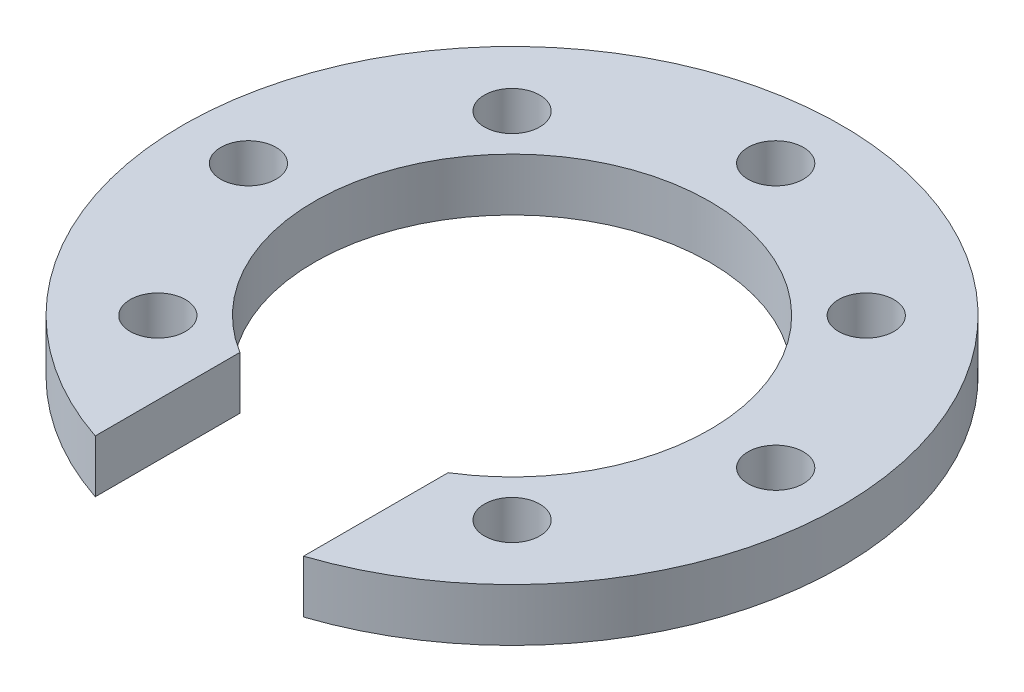
ISO-10303-21;
HEADER;
FILE_DESCRIPTION(('STEP AP214'),'2;1');
FILE_NAME('part.step','',(''),(''),'','','');
FILE_SCHEMA(('AUTOMOTIVE_DESIGN { 1 0 10303 214 1 1 1 1 }'));
ENDSEC;
DATA;
#1=APPLICATION_CONTEXT('core data for automotive mechanical design processes');
#2=APPLICATION_PROTOCOL_DEFINITION('international standard','automotive_design',2000,#1);
#3=PRODUCT_CONTEXT('',#1,'mechanical');
#4=PRODUCT('Part','Part','',(#3));
#5=PRODUCT_RELATED_PRODUCT_CATEGORY('part','',(#4));
#6=PRODUCT_DEFINITION_FORMATION('','',#4);
#7=PRODUCT_DEFINITION_CONTEXT('part definition',#1,'design');
#8=PRODUCT_DEFINITION('design','',#6,#7);
#9=PRODUCT_DEFINITION_SHAPE('','',#8);
#10=(LENGTH_UNIT() NAMED_UNIT(*) SI_UNIT(.MILLI.,.METRE.));
#11=(NAMED_UNIT(*) PLANE_ANGLE_UNIT() SI_UNIT($,.RADIAN.));
#12=(NAMED_UNIT(*) SI_UNIT($,.STERADIAN.) SOLID_ANGLE_UNIT());
#13=UNCERTAINTY_MEASURE_WITH_UNIT(LENGTH_MEASURE(1.E-05),#10,'distance_accuracy_value','');
#14=(GEOMETRIC_REPRESENTATION_CONTEXT(3) GLOBAL_UNCERTAINTY_ASSIGNED_CONTEXT((#13)) GLOBAL_UNIT_ASSIGNED_CONTEXT((#10,
#11,#12)) REPRESENTATION_CONTEXT('',''));
#15=CARTESIAN_POINT('',(0.,0.,0.));
#16=DIRECTION('',(0.,0.,1.));
#17=DIRECTION('',(1.,0.,0.));
#18=AXIS2_PLACEMENT_3D('',#15,#16,#17);
#19=CARTESIAN_POINT('',(0.,2.,0.));
#20=DIRECTION('',(0.,1.,0.));
#21=DIRECTION('',(0.,0.,1.));
#22=AXIS2_PLACEMENT_3D('',#19,#20,#21);
#23=PLANE('',#22);
#24=CARTESIAN_POINT('',(-6.71751442,2.,6.71751442));
#25=DIRECTION('',(0.,1.,0.));
#26=DIRECTION('',(0.,0.,1.));
#27=AXIS2_PLACEMENT_3D('',#24,#25,#26);
#28=CIRCLE('',#27,1.05);
#29=CARTESIAN_POINT('',(-6.71751442,2.,7.76751442));
#30=VERTEX_POINT('',#29);
#31=EDGE_CURVE('E137',#30,#30,#28,.T.);
#32=ORIENTED_EDGE('',*,*,#31,.F.);
#33=EDGE_LOOP('',(#32));
#34=FACE_BOUND('',#33,.T.);
#35=CARTESIAN_POINT('',(6.71751442,2.,6.71751442));
#36=DIRECTION('',(0.,1.,0.));
#37=DIRECTION('',(0.,0.,1.));
#38=AXIS2_PLACEMENT_3D('',#35,#36,#37);
#39=CIRCLE('',#38,1.05);
#40=CARTESIAN_POINT('',(6.71751442,2.,7.76751442));
#41=VERTEX_POINT('',#40);
#42=EDGE_CURVE('E148',#41,#41,#39,.T.);
#43=ORIENTED_EDGE('',*,*,#42,.F.);
#44=EDGE_LOOP('',(#43));
#45=FACE_BOUND('',#44,.T.);
#46=CARTESIAN_POINT('',(6.71751442,2.,-6.71751442));
#47=DIRECTION('',(0.,1.,0.));
#48=DIRECTION('',(0.,0.,1.));
#49=AXIS2_PLACEMENT_3D('',#46,#47,#48);
#50=CIRCLE('',#49,1.05);
#51=CARTESIAN_POINT('',(6.71751442,2.,-5.66751442));
#52=VERTEX_POINT('',#51);
#53=EDGE_CURVE('E142',#52,#52,#50,.T.);
#54=ORIENTED_EDGE('',*,*,#53,.F.);
#55=EDGE_LOOP('',(#54));
#56=FACE_BOUND('',#55,.T.);
#57=CARTESIAN_POINT('',(-6.71751442,2.,-6.71751442));
#58=DIRECTION('',(0.,1.,0.));
#59=DIRECTION('',(0.,0.,1.));
#60=AXIS2_PLACEMENT_3D('',#57,#58,#59);
#61=CIRCLE('',#60,1.05);
#62=CARTESIAN_POINT('',(-6.71751442,2.,-5.66751442));
#63=VERTEX_POINT('',#62);
#64=EDGE_CURVE('E141',#63,#63,#61,.T.);
#65=ORIENTED_EDGE('',*,*,#64,.F.);
#66=EDGE_LOOP('',(#65));
#67=FACE_BOUND('',#66,.T.);
#68=CARTESIAN_POINT('',(0.,2.,-10.));
#69=DIRECTION('',(0.,1.,0.));
#70=DIRECTION('',(1.,0.,0.));
#71=AXIS2_PLACEMENT_3D('',#68,#69,#70);
#72=CIRCLE('',#71,1.05);
#73=CARTESIAN_POINT('',(1.04999999999997,2.,-10.));
#74=VERTEX_POINT('',#73);
#75=EDGE_CURVE('E114',#74,#74,#72,.T.);
#76=ORIENTED_EDGE('',*,*,#75,.F.);
#77=EDGE_LOOP('',(#76));
#78=FACE_BOUND('',#77,.T.);
#79=CARTESIAN_POINT('',(-10.,2.,0.));
#80=DIRECTION('',(0.,1.,0.));
#81=DIRECTION('',(0.,0.,-1.));
#82=AXIS2_PLACEMENT_3D('',#79,#80,#81);
#83=CIRCLE('',#82,1.05);
#84=CARTESIAN_POINT('',(-10.,2.,-1.05));
#85=VERTEX_POINT('',#84);
#86=EDGE_CURVE('E123',#85,#85,#83,.T.);
#87=ORIENTED_EDGE('',*,*,#86,.F.);
#88=EDGE_LOOP('',(#87));
#89=FACE_BOUND('',#88,.T.);
#90=CARTESIAN_POINT('',(10.,2.,0.));
#91=DIRECTION('',(0.,1.,0.));
#92=DIRECTION('',(0.,0.,1.));
#93=AXIS2_PLACEMENT_3D('',#90,#91,#92);
#94=CIRCLE('',#93,1.05);
#95=CARTESIAN_POINT('',(10.,2.,1.05));
#96=VERTEX_POINT('',#95);
#97=EDGE_CURVE('E109',#96,#96,#94,.T.);
#98=ORIENTED_EDGE('',*,*,#97,.F.);
#99=EDGE_LOOP('',(#98));
#100=FACE_BOUND('',#99,.T.);
#101=CARTESIAN_POINT('',(0.,2.,0.));
#102=DIRECTION('',(0.,1.,0.));
#103=DIRECTION('',(0.,0.,1.));
#104=AXIS2_PLACEMENT_3D('',#101,#102,#103);
#105=CIRCLE('',#104,12.5);
#106=CARTESIAN_POINT('',(3.95,2.,11.8594898709852));
#107=VERTEX_POINT('',#106);
#108=CARTESIAN_POINT('',(-3.95,2.,11.8594898709852));
#109=VERTEX_POINT('',#108);
#110=EDGE_CURVE('E94',#107,#109,#105,.T.);
#111=ORIENTED_EDGE('',*,*,#110,.T.);
#112=DIRECTION('',(0.,0.,-1.));
#113=VECTOR('',#112,1.);
#114=CARTESIAN_POINT('',(-3.95,2.,0.));
#115=LINE('',#114,#113);
#116=CARTESIAN_POINT('',(-3.95,2.,6.37553919288401));
#117=VERTEX_POINT('',#116);
#118=EDGE_CURVE('E88',#109,#117,#115,.T.);
#119=ORIENTED_EDGE('',*,*,#118,.T.);
#120=CARTESIAN_POINT('',(0.,2.,0.));
#121=DIRECTION('',(0.,1.,0.));
#122=DIRECTION('',(0.,0.,1.));
#123=AXIS2_PLACEMENT_3D('',#120,#121,#122);
#124=CIRCLE('',#123,7.50000000000001);
#125=CARTESIAN_POINT('',(3.95,2.,6.37553919288401));
#126=VERTEX_POINT('',#125);
#127=EDGE_CURVE('E96',#126,#117,#124,.T.);
#128=ORIENTED_EDGE('',*,*,#127,.F.);
#129=DIRECTION('',(0.,0.,-1.));
#130=VECTOR('',#129,1.);
#131=CARTESIAN_POINT('',(3.95,2.,0.));
#132=LINE('',#131,#130);
#133=EDGE_CURVE('E63',#107,#126,#132,.T.);
#134=ORIENTED_EDGE('',*,*,#133,.F.);
#135=EDGE_LOOP('',(#111,#119,#128,#134));
#136=FACE_BOUND('',#135,.T.);
#137=ADVANCED_FACE('F41',(#34,#45,#56,#67,#78,#89,#100,#136),#23,.T.);
#138=CARTESIAN_POINT('',(0.,0.,0.));
#139=DIRECTION('',(0.,1.,0.));
#140=DIRECTION('',(0.,0.,1.));
#141=AXIS2_PLACEMENT_3D('',#138,#139,#140);
#142=PLANE('',#141);
#143=CARTESIAN_POINT('',(10.,0.,0.));
#144=DIRECTION('',(0.,1.,0.));
#145=DIRECTION('',(0.,0.,1.));
#146=AXIS2_PLACEMENT_3D('',#143,#144,#145);
#147=CIRCLE('',#146,1.05);
#148=CARTESIAN_POINT('',(10.,0.,1.05));
#149=VERTEX_POINT('',#148);
#150=EDGE_CURVE('E106',#149,#149,#147,.T.);
#151=ORIENTED_EDGE('',*,*,#150,.T.);
#152=EDGE_LOOP('',(#151));
#153=FACE_BOUND('',#152,.T.);
#154=CARTESIAN_POINT('',(-10.,0.,0.));
#155=DIRECTION('',(0.,1.,0.));
#156=DIRECTION('',(0.,0.,1.));
#157=AXIS2_PLACEMENT_3D('',#154,#155,#156);
#158=CIRCLE('',#157,1.05);
#159=CARTESIAN_POINT('',(-10.,0.,1.05));
#160=VERTEX_POINT('',#159);
#161=EDGE_CURVE('E110',#160,#160,#158,.T.);
#162=ORIENTED_EDGE('',*,*,#161,.T.);
#163=EDGE_LOOP('',(#162));
#164=FACE_BOUND('',#163,.T.);
#165=CARTESIAN_POINT('',(0.,0.,-10.));
#166=DIRECTION('',(0.,1.,0.));
#167=DIRECTION('',(0.,0.,1.));
#168=AXIS2_PLACEMENT_3D('',#165,#166,#167);
#169=CIRCLE('',#168,1.05);
#170=CARTESIAN_POINT('',(0.,0.,-8.95));
#171=VERTEX_POINT('',#170);
#172=EDGE_CURVE('E113',#171,#171,#169,.T.);
#173=ORIENTED_EDGE('',*,*,#172,.T.);
#174=EDGE_LOOP('',(#173));
#175=FACE_BOUND('',#174,.T.);
#176=CARTESIAN_POINT('',(-6.71751442,0.,-6.71751442));
#177=DIRECTION('',(0.,1.,0.));
#178=DIRECTION('',(0.,0.,1.));
#179=AXIS2_PLACEMENT_3D('',#176,#177,#178);
#180=CIRCLE('',#179,1.05);
#181=CARTESIAN_POINT('',(-6.71751442,0.,-5.66751442));
#182=VERTEX_POINT('',#181);
#183=EDGE_CURVE('E156',#182,#182,#180,.T.);
#184=ORIENTED_EDGE('',*,*,#183,.T.);
#185=EDGE_LOOP('',(#184));
#186=FACE_BOUND('',#185,.T.);
#187=CARTESIAN_POINT('',(6.71751442,0.,-6.71751442));
#188=DIRECTION('',(0.,1.,0.));
#189=DIRECTION('',(0.,0.,1.));
#190=AXIS2_PLACEMENT_3D('',#187,#188,#189);
#191=CIRCLE('',#190,1.05);
#192=CARTESIAN_POINT('',(6.71751442,0.,-5.66751442));
#193=VERTEX_POINT('',#192);
#194=EDGE_CURVE('E138',#193,#193,#191,.T.);
#195=ORIENTED_EDGE('',*,*,#194,.T.);
#196=EDGE_LOOP('',(#195));
#197=FACE_BOUND('',#196,.T.);
#198=CARTESIAN_POINT('',(6.71751442,0.,6.71751442));
#199=DIRECTION('',(0.,1.,0.));
#200=DIRECTION('',(0.,0.,1.));
#201=AXIS2_PLACEMENT_3D('',#198,#199,#200);
#202=CIRCLE('',#201,1.05);
#203=CARTESIAN_POINT('',(6.71751442,0.,7.76751442));
#204=VERTEX_POINT('',#203);
#205=EDGE_CURVE('E145',#204,#204,#202,.T.);
#206=ORIENTED_EDGE('',*,*,#205,.T.);
#207=EDGE_LOOP('',(#206));
#208=FACE_BOUND('',#207,.T.);
#209=CARTESIAN_POINT('',(-6.71751442,0.,6.71751442));
#210=DIRECTION('',(0.,1.,0.));
#211=DIRECTION('',(0.,0.,1.));
#212=AXIS2_PLACEMENT_3D('',#209,#210,#211);
#213=CIRCLE('',#212,1.05);
#214=CARTESIAN_POINT('',(-6.71751442,0.,7.76751442));
#215=VERTEX_POINT('',#214);
#216=EDGE_CURVE('E151',#215,#215,#213,.T.);
#217=ORIENTED_EDGE('',*,*,#216,.T.);
#218=EDGE_LOOP('',(#217));
#219=FACE_BOUND('',#218,.T.);
#220=DIRECTION('',(0.,0.,-1.));
#221=VECTOR('',#220,1.);
#222=CARTESIAN_POINT('',(-3.95,0.,0.));
#223=LINE('',#222,#221);
#224=CARTESIAN_POINT('',(-3.95,0.,11.8594898709852));
#225=VERTEX_POINT('',#224);
#226=CARTESIAN_POINT('',(-3.95,0.,6.37553919288401));
#227=VERTEX_POINT('',#226);
#228=EDGE_CURVE('E56',#225,#227,#223,.T.);
#229=ORIENTED_EDGE('',*,*,#228,.F.);
#230=CARTESIAN_POINT('',(0.,0.,0.));
#231=DIRECTION('',(0.,1.,0.));
#232=DIRECTION('',(0.,0.,1.));
#233=AXIS2_PLACEMENT_3D('',#230,#231,#232);
#234=CIRCLE('',#233,12.5);
#235=CARTESIAN_POINT('',(3.95,0.,11.8594898709852));
#236=VERTEX_POINT('',#235);
#237=EDGE_CURVE('E99',#236,#225,#234,.T.);
#238=ORIENTED_EDGE('',*,*,#237,.F.);
#239=DIRECTION('',(0.,0.,-1.));
#240=VECTOR('',#239,1.);
#241=CARTESIAN_POINT('',(3.95,0.,0.));
#242=LINE('',#241,#240);
#243=CARTESIAN_POINT('',(3.95,0.,6.37553919288401));
#244=VERTEX_POINT('',#243);
#245=EDGE_CURVE('E82',#236,#244,#242,.T.);
#246=ORIENTED_EDGE('',*,*,#245,.T.);
#247=CARTESIAN_POINT('',(0.,0.,0.));
#248=DIRECTION('',(0.,1.,0.));
#249=DIRECTION('',(0.,0.,1.));
#250=AXIS2_PLACEMENT_3D('',#247,#248,#249);
#251=CIRCLE('',#250,7.50000000000001);
#252=EDGE_CURVE('E103',#244,#227,#251,.T.);
#253=ORIENTED_EDGE('',*,*,#252,.T.);
#254=EDGE_LOOP('',(#229,#238,#246,#253));
#255=FACE_BOUND('',#254,.T.);
#256=ADVANCED_FACE('F129',(#153,#164,#175,#186,#197,#208,#219,#255),#142,.F.);
#257=CARTESIAN_POINT('',(0.,2.,0.));
#258=DIRECTION('',(0.,-1.,0.));
#259=DIRECTION('',(0.,0.,-1.));
#260=AXIS2_PLACEMENT_3D('',#257,#258,#259);
#261=CYLINDRICAL_SURFACE('',#260,12.5);
#262=DIRECTION('',(0.,1.,0.));
#263=VECTOR('',#262,1.);
#264=CARTESIAN_POINT('',(-3.95,-8.,11.8594898709852));
#265=LINE('',#264,#263);
#266=EDGE_CURVE('E87',#225,#109,#265,.T.);
#267=ORIENTED_EDGE('',*,*,#266,.T.);
#268=ORIENTED_EDGE('',*,*,#110,.F.);
#269=DIRECTION('',(0.,1.,0.));
#270=VECTOR('',#269,1.);
#271=CARTESIAN_POINT('',(3.95,-8.,11.8594898709852));
#272=LINE('',#271,#270);
#273=EDGE_CURVE('E79',#236,#107,#272,.T.);
#274=ORIENTED_EDGE('',*,*,#273,.F.);
#275=ORIENTED_EDGE('',*,*,#237,.T.);
#276=EDGE_LOOP('',(#267,#268,#274,#275));
#277=FACE_BOUND('',#276,.T.);
#278=ADVANCED_FACE('F43',(#277),#261,.T.);
#279=CARTESIAN_POINT('',(0.,2.,0.));
#280=DIRECTION('',(0.,-1.,0.));
#281=DIRECTION('',(0.,0.,-1.));
#282=AXIS2_PLACEMENT_3D('',#279,#280,#281);
#283=CYLINDRICAL_SURFACE('',#282,7.50000000000001);
#284=ORIENTED_EDGE('',*,*,#127,.T.);
#285=DIRECTION('',(0.,-1.,0.));
#286=VECTOR('',#285,1.);
#287=CARTESIAN_POINT('',(-3.95,2.,6.37553919288401));
#288=LINE('',#287,#286);
#289=EDGE_CURVE('E11',#117,#227,#288,.T.);
#290=ORIENTED_EDGE('',*,*,#289,.T.);
#291=ORIENTED_EDGE('',*,*,#252,.F.);
#292=DIRECTION('',(0.,-1.,0.));
#293=VECTOR('',#292,1.);
#294=CARTESIAN_POINT('',(3.95,2.,6.37553919288401));
#295=LINE('',#294,#293);
#296=EDGE_CURVE('E49',#126,#244,#295,.T.);
#297=ORIENTED_EDGE('',*,*,#296,.F.);
#298=EDGE_LOOP('',(#284,#290,#291,#297));
#299=FACE_BOUND('',#298,.T.);
#300=ADVANCED_FACE('F130',(#299),#283,.F.);
#301=CARTESIAN_POINT('',(10.,-3.,0.));
#302=DIRECTION('',(0.,1.,0.));
#303=DIRECTION('',(0.,0.,1.));
#304=AXIS2_PLACEMENT_3D('',#301,#302,#303);
#305=CYLINDRICAL_SURFACE('',#304,1.05);
#306=ORIENTED_EDGE('',*,*,#97,.T.);
#307=EDGE_LOOP('',(#306));
#308=FACE_BOUND('',#307,.T.);
#309=ORIENTED_EDGE('',*,*,#150,.F.);
#310=EDGE_LOOP('',(#309));
#311=FACE_BOUND('',#310,.T.);
#312=ADVANCED_FACE('F182',(#308,#311),#305,.F.);
#313=CARTESIAN_POINT('',(-10.,-3.,0.));
#314=DIRECTION('',(0.,1.,0.));
#315=DIRECTION('',(0.,0.,1.));
#316=AXIS2_PLACEMENT_3D('',#313,#314,#315);
#317=CYLINDRICAL_SURFACE('',#316,1.05);
#318=ORIENTED_EDGE('',*,*,#86,.T.);
#319=EDGE_LOOP('',(#318));
#320=FACE_BOUND('',#319,.T.);
#321=ORIENTED_EDGE('',*,*,#161,.F.);
#322=EDGE_LOOP('',(#321));
#323=FACE_BOUND('',#322,.T.);
#324=ADVANCED_FACE('F166',(#320,#323),#317,.F.);
#325=CARTESIAN_POINT('',(0.,-3.,-10.));
#326=DIRECTION('',(0.,1.,0.));
#327=DIRECTION('',(0.,0.,1.));
#328=AXIS2_PLACEMENT_3D('',#325,#326,#327);
#329=CYLINDRICAL_SURFACE('',#328,1.05);
#330=ORIENTED_EDGE('',*,*,#75,.T.);
#331=EDGE_LOOP('',(#330));
#332=FACE_BOUND('',#331,.T.);
#333=ORIENTED_EDGE('',*,*,#172,.F.);
#334=EDGE_LOOP('',(#333));
#335=FACE_BOUND('',#334,.T.);
#336=ADVANCED_FACE('F187',(#332,#335),#329,.F.);
#337=CARTESIAN_POINT('',(-6.71751442,0.,-6.71751442));
#338=DIRECTION('',(0.,1.,0.));
#339=DIRECTION('',(0.,0.,1.));
#340=AXIS2_PLACEMENT_3D('',#337,#338,#339);
#341=CYLINDRICAL_SURFACE('',#340,1.05);
#342=ORIENTED_EDGE('',*,*,#183,.F.);
#343=EDGE_LOOP('',(#342));
#344=FACE_BOUND('',#343,.T.);
#345=ORIENTED_EDGE('',*,*,#64,.T.);
#346=EDGE_LOOP('',(#345));
#347=FACE_BOUND('',#346,.T.);
#348=ADVANCED_FACE('F190',(#344,#347),#341,.F.);
#349=CARTESIAN_POINT('',(6.71751442,0.,-6.71751442));
#350=DIRECTION('',(0.,1.,0.));
#351=DIRECTION('',(0.,0.,1.));
#352=AXIS2_PLACEMENT_3D('',#349,#350,#351);
#353=CYLINDRICAL_SURFACE('',#352,1.05);
#354=ORIENTED_EDGE('',*,*,#194,.F.);
#355=EDGE_LOOP('',(#354));
#356=FACE_BOUND('',#355,.T.);
#357=ORIENTED_EDGE('',*,*,#53,.T.);
#358=EDGE_LOOP('',(#357));
#359=FACE_BOUND('',#358,.T.);
#360=ADVANCED_FACE('F193',(#356,#359),#353,.F.);
#361=CARTESIAN_POINT('',(6.71751442,0.,6.71751442));
#362=DIRECTION('',(0.,1.,0.));
#363=DIRECTION('',(0.,0.,1.));
#364=AXIS2_PLACEMENT_3D('',#361,#362,#363);
#365=CYLINDRICAL_SURFACE('',#364,1.05);
#366=ORIENTED_EDGE('',*,*,#205,.F.);
#367=EDGE_LOOP('',(#366));
#368=FACE_BOUND('',#367,.T.);
#369=ORIENTED_EDGE('',*,*,#42,.T.);
#370=EDGE_LOOP('',(#369));
#371=FACE_BOUND('',#370,.T.);
#372=ADVANCED_FACE('F198',(#368,#371),#365,.F.);
#373=CARTESIAN_POINT('',(-6.71751442,0.,6.71751442));
#374=DIRECTION('',(0.,1.,0.));
#375=DIRECTION('',(0.,0.,1.));
#376=AXIS2_PLACEMENT_3D('',#373,#374,#375);
#377=CYLINDRICAL_SURFACE('',#376,1.05);
#378=ORIENTED_EDGE('',*,*,#216,.F.);
#379=EDGE_LOOP('',(#378));
#380=FACE_BOUND('',#379,.T.);
#381=ORIENTED_EDGE('',*,*,#31,.T.);
#382=EDGE_LOOP('',(#381));
#383=FACE_BOUND('',#382,.T.);
#384=ADVANCED_FACE('F195',(#380,#383),#377,.F.);
#385=CARTESIAN_POINT('',(3.95,-8.,0.));
#386=DIRECTION('',(1.,0.,0.));
#387=DIRECTION('',(0.,0.,-1.));
#388=AXIS2_PLACEMENT_3D('',#385,#386,#387);
#389=PLANE('',#388);
#390=ORIENTED_EDGE('',*,*,#273,.T.);
#391=ORIENTED_EDGE('',*,*,#133,.T.);
#392=ORIENTED_EDGE('',*,*,#296,.T.);
#393=ORIENTED_EDGE('',*,*,#245,.F.);
#394=EDGE_LOOP('',(#390,#391,#392,#393));
#395=FACE_BOUND('',#394,.T.);
#396=ADVANCED_FACE('F80',(#395),#389,.F.);
#397=CARTESIAN_POINT('',(-3.95,-8.,0.));
#398=DIRECTION('',(1.,0.,0.));
#399=DIRECTION('',(0.,0.,-1.));
#400=AXIS2_PLACEMENT_3D('',#397,#398,#399);
#401=PLANE('',#400);
#402=ORIENTED_EDGE('',*,*,#228,.T.);
#403=ORIENTED_EDGE('',*,*,#289,.F.);
#404=ORIENTED_EDGE('',*,*,#118,.F.);
#405=ORIENTED_EDGE('',*,*,#266,.F.);
#406=EDGE_LOOP('',(#402,#403,#404,#405));
#407=FACE_BOUND('',#406,.T.);
#408=ADVANCED_FACE('F131',(#407),#401,.T.);
#409=CLOSED_SHELL('',(#137,#256,#278,#300,#312,#324,#336,#348,#360,#372,#384,#396,#408));
#410=MANIFOLD_SOLID_BREP('B2',#409);
#411=ADVANCED_BREP_SHAPE_REPRESENTATION('',(#18,#410),#14);
#412=SHAPE_DEFINITION_REPRESENTATION(#9,#411);
ENDSEC;
END-ISO-10303-21;
